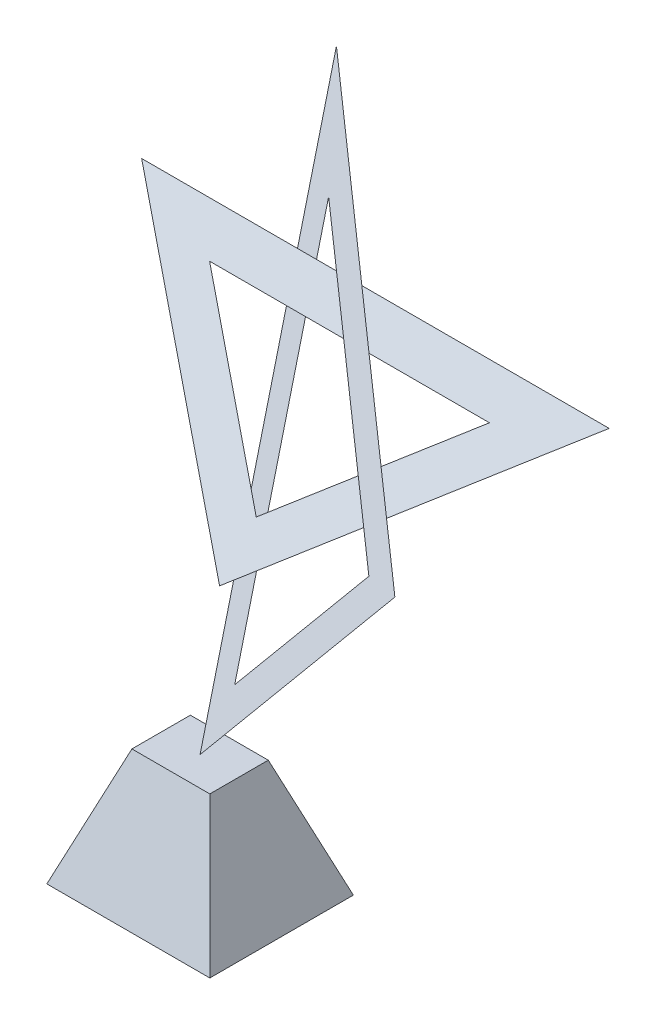
ISO-10303-21;
HEADER;
FILE_DESCRIPTION(('STEP AP214'),'2;1');
FILE_NAME('part.step','',(''),(''),'','','');
FILE_SCHEMA(('AUTOMOTIVE_DESIGN { 1 0 10303 214 1 1 1 1 }'));
ENDSEC;
DATA;
#1=APPLICATION_CONTEXT('core data for automotive mechanical design processes');
#2=APPLICATION_PROTOCOL_DEFINITION('international standard','automotive_design',2000,#1);
#3=PRODUCT_CONTEXT('',#1,'mechanical');
#4=PRODUCT('Part','Part','',(#3));
#5=PRODUCT_RELATED_PRODUCT_CATEGORY('part','',(#4));
#6=PRODUCT_DEFINITION_FORMATION('','',#4);
#7=PRODUCT_DEFINITION_CONTEXT('part definition',#1,'design');
#8=PRODUCT_DEFINITION('design','',#6,#7);
#9=PRODUCT_DEFINITION_SHAPE('','',#8);
#10=(LENGTH_UNIT() NAMED_UNIT(*) SI_UNIT(.MILLI.,.METRE.));
#11=(NAMED_UNIT(*) PLANE_ANGLE_UNIT() SI_UNIT($,.RADIAN.));
#12=(NAMED_UNIT(*) SI_UNIT($,.STERADIAN.) SOLID_ANGLE_UNIT());
#13=UNCERTAINTY_MEASURE_WITH_UNIT(LENGTH_MEASURE(1.E-05),#10,'distance_accuracy_value','');
#14=(GEOMETRIC_REPRESENTATION_CONTEXT(3) GLOBAL_UNCERTAINTY_ASSIGNED_CONTEXT((#13)) GLOBAL_UNIT_ASSIGNED_CONTEXT((#10,
#11,#12)) REPRESENTATION_CONTEXT('',''));
#15=CARTESIAN_POINT('',(0.,0.,0.));
#16=DIRECTION('',(0.,0.,1.));
#17=DIRECTION('',(1.,0.,0.));
#18=AXIS2_PLACEMENT_3D('',#15,#16,#17);
#19=CARTESIAN_POINT('',(195.,0.,67.5));
#20=DIRECTION('',(-0.939692620785908,0.342020143325669,0.));
#21=DIRECTION('',(-0.342020143325669,-0.939692620785909,0.));
#22=AXIS2_PLACEMENT_3D('',#19,#20,#21);
#23=PLANE('',#22);
#24=DIRECTION('',(0.,0.,1.));
#25=VECTOR('',#24,1.);
#26=CARTESIAN_POINT('',(195.,0.,67.5));
#27=LINE('',#26,#25);
#28=CARTESIAN_POINT('',(195.,0.,67.5));
#29=VERTEX_POINT('',#28);
#30=CARTESIAN_POINT('',(195.,0.,82.5));
#31=VERTEX_POINT('',#30);
#32=EDGE_CURVE('E96',#29,#31,#27,.T.);
#33=ORIENTED_EDGE('',*,*,#32,.F.);
#34=DIRECTION('',(0.323615577118185,0.889126490715988,0.323615577118185));
#35=VECTOR('',#34,1.);
#36=CARTESIAN_POINT('',(197.094540835071,5.75470364848242,69.5945408350707));
#37=LINE('',#36,#35);
#38=CARTESIAN_POINT('',(184.080892972014,-30.,56.5808929720139));
#39=VERTEX_POINT('',#38);
#40=EDGE_CURVE('E12',#39,#29,#37,.T.);
#41=ORIENTED_EDGE('',*,*,#40,.F.);
#42=DIRECTION('',(0.,0.,1.));
#43=VECTOR('',#42,1.);
#44=CARTESIAN_POINT('',(184.080892972014,-30.,67.5));
#45=LINE('',#44,#43);
#46=CARTESIAN_POINT('',(184.080892972014,-30.,93.4191070279861));
#47=VERTEX_POINT('',#46);
#48=EDGE_CURVE('E98',#39,#47,#45,.T.);
#49=ORIENTED_EDGE('',*,*,#48,.T.);
#50=DIRECTION('',(0.323615577118185,0.889126490715988,-0.323615577118185));
#51=VECTOR('',#50,1.);
#52=CARTESIAN_POINT('',(196.570905626303,4.31602773636181,80.929094373697));
#53=LINE('',#52,#51);
#54=EDGE_CURVE('E83',#47,#31,#53,.T.);
#55=ORIENTED_EDGE('',*,*,#54,.T.);
#56=EDGE_LOOP('',(#33,#41,#49,#55));
#57=FACE_BOUND('',#56,.T.);
#58=ADVANCED_FACE('F46',(#57),#23,.T.);
#59=CARTESIAN_POINT('',(215.,0.,67.5));
#60=DIRECTION('',(0.,0.342020143325669,-0.939692620785908));
#61=DIRECTION('',(0.,0.939692620785909,0.342020143325669));
#62=AXIS2_PLACEMENT_3D('',#59,#60,#61);
#63=PLANE('',#62);
#64=DIRECTION('',(-1.,0.,0.));
#65=VECTOR('',#64,1.);
#66=CARTESIAN_POINT('',(215.,0.,67.5));
#67=LINE('',#66,#65);
#68=CARTESIAN_POINT('',(215.,0.,67.5));
#69=VERTEX_POINT('',#68);
#70=EDGE_CURVE('E108',#69,#29,#67,.T.);
#71=ORIENTED_EDGE('',*,*,#70,.F.);
#72=DIRECTION('',(-0.323615577118185,0.889126490715988,0.323615577118185));
#73=VECTOR('',#72,1.);
#74=CARTESIAN_POINT('',(215.,0.,67.5));
#75=LINE('',#74,#73);
#76=CARTESIAN_POINT('',(225.919107027986,-30.,56.5808929720139));
#77=VERTEX_POINT('',#76);
#78=EDGE_CURVE('E56',#77,#69,#75,.T.);
#79=ORIENTED_EDGE('',*,*,#78,.F.);
#80=DIRECTION('',(-1.,0.,0.));
#81=VECTOR('',#80,1.);
#82=CARTESIAN_POINT('',(215.,-30.,56.5808929720139));
#83=LINE('',#82,#81);
#84=EDGE_CURVE('E99',#77,#39,#83,.T.);
#85=ORIENTED_EDGE('',*,*,#84,.T.);
#86=ORIENTED_EDGE('',*,*,#40,.T.);
#87=EDGE_LOOP('',(#71,#79,#85,#86));
#88=FACE_BOUND('',#87,.T.);
#89=ADVANCED_FACE('F48',(#88),#63,.T.);
#90=CARTESIAN_POINT('',(215.,0.,67.5));
#91=DIRECTION('',(0.939692620785908,0.342020143325669,0.));
#92=DIRECTION('',(-0.342020143325669,0.939692620785909,0.));
#93=AXIS2_PLACEMENT_3D('',#90,#91,#92);
#94=PLANE('',#93);
#95=DIRECTION('',(0.,0.,-1.));
#96=VECTOR('',#95,1.);
#97=CARTESIAN_POINT('',(215.,0.,67.5));
#98=LINE('',#97,#96);
#99=CARTESIAN_POINT('',(215.,0.,82.5));
#100=VERTEX_POINT('',#99);
#101=EDGE_CURVE('E105',#100,#69,#98,.T.);
#102=ORIENTED_EDGE('',*,*,#101,.F.);
#103=DIRECTION('',(-0.323615577118185,0.889126490715988,-0.323615577118185));
#104=VECTOR('',#103,1.);
#105=CARTESIAN_POINT('',(215.,0.,82.5));
#106=LINE('',#105,#104);
#107=CARTESIAN_POINT('',(225.919107027986,-30.,93.4191070279861));
#108=VERTEX_POINT('',#107);
#109=EDGE_CURVE('E76',#108,#100,#106,.T.);
#110=ORIENTED_EDGE('',*,*,#109,.F.);
#111=DIRECTION('',(0.,0.,-1.));
#112=VECTOR('',#111,1.);
#113=CARTESIAN_POINT('',(225.919107027986,-30.,67.5));
#114=LINE('',#113,#112);
#115=EDGE_CURVE('E116',#108,#77,#114,.T.);
#116=ORIENTED_EDGE('',*,*,#115,.T.);
#117=ORIENTED_EDGE('',*,*,#78,.T.);
#118=EDGE_LOOP('',(#102,#110,#116,#117));
#119=FACE_BOUND('',#118,.T.);
#120=ADVANCED_FACE('F121',(#119),#94,.T.);
#121=CARTESIAN_POINT('',(215.,0.,82.5));
#122=DIRECTION('',(0.,0.342020143325669,0.939692620785908));
#123=DIRECTION('',(0.,-0.939692620785909,0.342020143325669));
#124=AXIS2_PLACEMENT_3D('',#121,#122,#123);
#125=PLANE('',#124);
#126=DIRECTION('',(1.,0.,0.));
#127=VECTOR('',#126,1.);
#128=CARTESIAN_POINT('',(215.,0.,82.5));
#129=LINE('',#128,#127);
#130=EDGE_CURVE('E102',#31,#100,#129,.T.);
#131=ORIENTED_EDGE('',*,*,#130,.F.);
#132=ORIENTED_EDGE('',*,*,#54,.F.);
#133=DIRECTION('',(1.,0.,0.));
#134=VECTOR('',#133,1.);
#135=CARTESIAN_POINT('',(215.,-30.,93.4191070279861));
#136=LINE('',#135,#134);
#137=EDGE_CURVE('E50',#47,#108,#136,.T.);
#138=ORIENTED_EDGE('',*,*,#137,.T.);
#139=ORIENTED_EDGE('',*,*,#109,.T.);
#140=EDGE_LOOP('',(#131,#132,#138,#139));
#141=FACE_BOUND('',#140,.T.);
#142=ADVANCED_FACE('F103',(#141),#125,.T.);
#143=CARTESIAN_POINT('',(0.,-30.,0.));
#144=DIRECTION('',(0.,-1.,0.));
#145=DIRECTION('',(0.,0.,-1.));
#146=AXIS2_PLACEMENT_3D('',#143,#144,#145);
#147=PLANE('',#146);
#148=ORIENTED_EDGE('',*,*,#48,.F.);
#149=ORIENTED_EDGE('',*,*,#84,.F.);
#150=ORIENTED_EDGE('',*,*,#115,.F.);
#151=ORIENTED_EDGE('',*,*,#137,.F.);
#152=EDGE_LOOP('',(#148,#149,#150,#151));
#153=FACE_BOUND('',#152,.T.);
#154=ADVANCED_FACE('F119',(#153),#147,.T.);
#155=CARTESIAN_POINT('',(0.,0.,0.));
#156=DIRECTION('',(0.,-1.,0.));
#157=DIRECTION('',(0.,0.,-1.));
#158=AXIS2_PLACEMENT_3D('',#155,#156,#157);
#159=PLANE('',#158);
#160=ORIENTED_EDGE('',*,*,#32,.T.);
#161=ORIENTED_EDGE('',*,*,#130,.T.);
#162=ORIENTED_EDGE('',*,*,#101,.T.);
#163=ORIENTED_EDGE('',*,*,#70,.T.);
#164=EDGE_LOOP('',(#160,#161,#162,#163));
#165=FACE_BOUND('',#164,.T.);
#166=ADVANCED_FACE('F107',(#165),#159,.F.);
#167=CLOSED_SHELL('',(#58,#89,#120,#142,#154,#166));
#168=MANIFOLD_SOLID_BREP('B2',#167);
#169=CARTESIAN_POINT('',(9.16666666666666,-9.16666666666666,-18.3333333333333));
#170=DIRECTION('',(0.408248290463863,-0.408248290463863,-0.816496580927726));
#171=DIRECTION('',(-0.894427190999916,0.,-0.447213595499958));
#172=AXIS2_PLACEMENT_3D('',#169,#170,#171);
#173=PLANE('',#172);
#174=DIRECTION('',(0.698297248755175,-0.436435780471985,0.56736651461358));
#175=VECTOR('',#174,1.);
#176=CARTESIAN_POINT('',(184.229283020365,86.7525546453373,21.2383641875137));
#177=LINE('',#176,#175);
#178=CARTESIAN_POINT('',(184.229283020365,86.7525546453373,21.2383641875137));
#179=VERTEX_POINT('',#178);
#180=CARTESIAN_POINT('',(239.338130777482,52.3095247971389,66.0143029901716));
#181=VERTEX_POINT('',#180);
#182=EDGE_CURVE('E206',#179,#181,#177,.T.);
#183=ORIENTED_EDGE('',*,*,#182,.F.);
#184=DIRECTION('',(-0.267261241912424,0.801783725737273,-0.534522483824849));
#185=VECTOR('',#184,1.);
#186=CARTESIAN_POINT('',(208.339403914103,14.4221919641206,69.4586059749915));
#187=LINE('',#186,#185);
#188=CARTESIAN_POINT('',(208.339403914103,14.4221919641206,69.4586059749915));
#189=VERTEX_POINT('',#188);
#190=EDGE_CURVE('E208',#189,#179,#187,.T.);
#191=ORIENTED_EDGE('',*,*,#190,.F.);
#192=DIRECTION('',(-0.631676165709237,-0.772048646977956,0.0701862406343592));
#193=VECTOR('',#192,1.);
#194=CARTESIAN_POINT('',(239.338130777482,52.3095247971389,66.0143029901716));
#195=LINE('',#194,#193);
#196=EDGE_CURVE('E210',#181,#189,#195,.T.);
#197=ORIENTED_EDGE('',*,*,#196,.F.);
#198=EDGE_LOOP('',(#183,#191,#197));
#199=FACE_BOUND('',#198,.T.);
#200=DIRECTION('',(0.698297248755176,-0.436435780471985,0.56736651461358));
#201=VECTOR('',#200,1.);
#202=CARTESIAN_POINT('',(170.,105.,5.00000000000002));
#203=LINE('',#202,#201);
#204=CARTESIAN_POINT('',(170.,105.,5.00000000000002));
#205=VERTEX_POINT('',#204);
#206=CARTESIAN_POINT('',(250.,55.,70.));
#207=VERTEX_POINT('',#206);
#208=EDGE_CURVE('E188',#205,#207,#203,.T.);
#209=ORIENTED_EDGE('',*,*,#208,.T.);
#210=DIRECTION('',(-0.631676165709237,-0.772048646977956,0.0701862406343593));
#211=VECTOR('',#210,1.);
#212=CARTESIAN_POINT('',(250.,55.,70.));
#213=LINE('',#212,#211);
#214=CARTESIAN_POINT('',(205.,0.,75.));
#215=VERTEX_POINT('',#214);
#216=EDGE_CURVE('E184',#207,#215,#213,.T.);
#217=ORIENTED_EDGE('',*,*,#216,.T.);
#218=DIRECTION('',(-0.267261241912424,0.801783725737273,-0.534522483824849));
#219=VECTOR('',#218,1.);
#220=CARTESIAN_POINT('',(205.,0.,75.));
#221=LINE('',#220,#219);
#222=EDGE_CURVE('E44',#215,#205,#221,.T.);
#223=ORIENTED_EDGE('',*,*,#222,.T.);
#224=EDGE_LOOP('',(#209,#217,#223));
#225=FACE_BOUND('',#224,.T.);
#226=ADVANCED_FACE('F179',(#199,#225),#173,.T.);
#227=OPEN_SHELL('',(#226));
#228=SHELL_BASED_SURFACE_MODEL('B6',(#227));
#229=CARTESIAN_POINT('',(0.,50.2068965517241,56.4827586206897));
#230=DIRECTION('',(0.,-0.66436383882992,-0.74740931868366));
#231=DIRECTION('',(0.,0.74740931868366,-0.66436383882992));
#232=AXIS2_PLACEMENT_3D('',#229,#230,#231);
#233=PLANE('',#232);
#234=DIRECTION('',(0.705882352941177,0.529411764705882,-0.470588235294117));
#235=VECTOR('',#234,1.);
#236=CARTESIAN_POINT('',(205.,35.,70.));
#237=LINE('',#236,#235);
#238=CARTESIAN_POINT('',(205.,35.,70.));
#239=VERTEX_POINT('',#238);
#240=CARTESIAN_POINT('',(265.,80.,30.));
#241=VERTEX_POINT('',#240);
#242=EDGE_CURVE('E269',#239,#241,#237,.T.);
#243=ORIENTED_EDGE('',*,*,#242,.T.);
#244=DIRECTION('',(-1.,0.,0.));
#245=VECTOR('',#244,1.);
#246=CARTESIAN_POINT('',(265.,80.,30.));
#247=LINE('',#246,#245);
#248=CARTESIAN_POINT('',(145.,80.,30.));
#249=VERTEX_POINT('',#248);
#250=EDGE_CURVE('E271',#241,#249,#247,.T.);
#251=ORIENTED_EDGE('',*,*,#250,.T.);
#252=DIRECTION('',(0.705882352941176,-0.529411764705883,0.470588235294118));
#253=VECTOR('',#252,1.);
#254=CARTESIAN_POINT('',(145.,80.,30.));
#255=LINE('',#254,#253);
#256=EDGE_CURVE('E273',#249,#239,#255,.T.);
#257=ORIENTED_EDGE('',*,*,#256,.T.);
#258=EDGE_LOOP('',(#243,#251,#257));
#259=FACE_BOUND('',#258,.T.);
#260=DIRECTION('',(0.705882352941177,0.529411764705882,-0.470588235294118));
#261=VECTOR('',#260,1.);
#262=CARTESIAN_POINT('',(205.,45.5882986813519,60.5881789499095));
#263=LINE('',#262,#261);
#264=CARTESIAN_POINT('',(205.,45.5882986813519,60.5881789499095));
#265=VERTEX_POINT('',#264);
#266=CARTESIAN_POINT('',(240.916810842415,72.5259068131634,36.6436383882992));
#267=VERTEX_POINT('',#266);
#268=EDGE_CURVE('E251',#265,#267,#263,.T.);
#269=ORIENTED_EDGE('',*,*,#268,.F.);
#270=DIRECTION('',(0.705882352941176,-0.529411764705883,0.470588235294118));
#271=VECTOR('',#270,1.);
#272=CARTESIAN_POINT('',(169.083189157585,72.5259068131634,36.6436383882992));
#273=LINE('',#272,#271);
#274=CARTESIAN_POINT('',(169.083189157585,72.5259068131634,36.6436383882992));
#275=VERTEX_POINT('',#274);
#276=EDGE_CURVE('E247',#275,#265,#273,.T.);
#277=ORIENTED_EDGE('',*,*,#276,.F.);
#278=DIRECTION('',(-1.,0.,0.));
#279=VECTOR('',#278,1.);
#280=CARTESIAN_POINT('',(240.916810842415,72.5259068131634,36.6436383882992));
#281=LINE('',#280,#279);
#282=EDGE_CURVE('E177',#267,#275,#281,.T.);
#283=ORIENTED_EDGE('',*,*,#282,.F.);
#284=EDGE_LOOP('',(#269,#277,#283));
#285=FACE_BOUND('',#284,.T.);
#286=ADVANCED_FACE('F242',(#259,#285),#233,.F.);
#287=OPEN_SHELL('',(#286));
#288=SHELL_BASED_SURFACE_MODEL('B38',(#287));
#289=ADVANCED_BREP_SHAPE_REPRESENTATION('',(#18,#168),#14);
#290=MANIFOLD_SURFACE_SHAPE_REPRESENTATION('',(#18,#228,#288),#14);
#291=SHAPE_REPRESENTATION('',(#18),#14);
#292=SHAPE_DEFINITION_REPRESENTATION(#9,#291);
#293=SHAPE_REPRESENTATION_RELATIONSHIP('','',#291,#289);
#294=SHAPE_REPRESENTATION_RELATIONSHIP('','',#291,#290);
ENDSEC;
END-ISO-10303-21;
